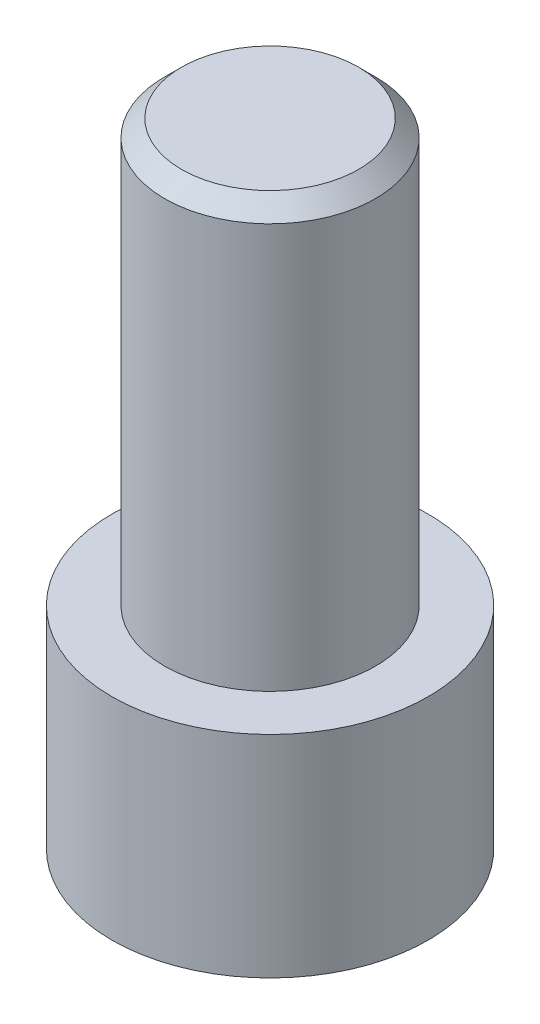
ISO-10303-21;
HEADER;
FILE_DESCRIPTION(('STEP AP214'),'2;1');
FILE_NAME('part.step','',(''),(''),'','','');
FILE_SCHEMA(('AUTOMOTIVE_DESIGN { 1 0 10303 214 1 1 1 1 }'));
ENDSEC;
DATA;
#1=APPLICATION_CONTEXT('core data for automotive mechanical design processes');
#2=APPLICATION_PROTOCOL_DEFINITION('international standard','automotive_design',2000,#1);
#3=PRODUCT_CONTEXT('',#1,'mechanical');
#4=PRODUCT('Part','Part','',(#3));
#5=PRODUCT_RELATED_PRODUCT_CATEGORY('part','',(#4));
#6=PRODUCT_DEFINITION_FORMATION('','',#4);
#7=PRODUCT_DEFINITION_CONTEXT('part definition',#1,'design');
#8=PRODUCT_DEFINITION('design','',#6,#7);
#9=PRODUCT_DEFINITION_SHAPE('','',#8);
#10=(LENGTH_UNIT() NAMED_UNIT(*) SI_UNIT(.MILLI.,.METRE.));
#11=(NAMED_UNIT(*) PLANE_ANGLE_UNIT() SI_UNIT($,.RADIAN.));
#12=(NAMED_UNIT(*) SI_UNIT($,.STERADIAN.) SOLID_ANGLE_UNIT());
#13=UNCERTAINTY_MEASURE_WITH_UNIT(LENGTH_MEASURE(1.E-05),#10,'distance_accuracy_value','');
#14=(GEOMETRIC_REPRESENTATION_CONTEXT(3) GLOBAL_UNCERTAINTY_ASSIGNED_CONTEXT((#13)) GLOBAL_UNIT_ASSIGNED_CONTEXT((#10,
#11,#12)) REPRESENTATION_CONTEXT('',''));
#15=CARTESIAN_POINT('',(0.,0.,0.));
#16=DIRECTION('',(0.,0.,1.));
#17=DIRECTION('',(1.,0.,0.));
#18=AXIS2_PLACEMENT_3D('',#15,#16,#17);
#19=CARTESIAN_POINT('',(0.,-6.35,0.));
#20=DIRECTION('',(0.,1.,0.));
#21=DIRECTION('',(0.,0.,1.));
#22=AXIS2_PLACEMENT_3D('',#19,#20,#21);
#23=CYLINDRICAL_SURFACE('',#22,4.7625);
#24=CARTESIAN_POINT('',(0.,-6.35,0.));
#25=DIRECTION('',(0.,1.,0.));
#26=DIRECTION('',(0.,0.,1.));
#27=AXIS2_PLACEMENT_3D('',#24,#25,#26);
#28=CIRCLE('',#27,4.7625);
#29=CARTESIAN_POINT('',(0.,-6.35,4.7625));
#30=VERTEX_POINT('',#29);
#31=EDGE_CURVE('E170',#30,#30,#28,.T.);
#32=ORIENTED_EDGE('',*,*,#31,.T.);
#33=EDGE_LOOP('',(#32));
#34=FACE_BOUND('',#33,.T.);
#35=CARTESIAN_POINT('',(0.,0.,0.));
#36=DIRECTION('',(0.,1.,0.));
#37=DIRECTION('',(0.,0.,1.));
#38=AXIS2_PLACEMENT_3D('',#35,#36,#37);
#39=CIRCLE('',#38,4.7625);
#40=CARTESIAN_POINT('',(0.,0.,4.7625));
#41=VERTEX_POINT('',#40);
#42=EDGE_CURVE('E156',#41,#41,#39,.T.);
#43=ORIENTED_EDGE('',*,*,#42,.F.);
#44=EDGE_LOOP('',(#43));
#45=FACE_BOUND('',#44,.T.);
#46=ADVANCED_FACE('F41',(#34,#45),#23,.T.);
#47=CARTESIAN_POINT('',(0.,-6.35,0.));
#48=DIRECTION('',(0.,1.,0.));
#49=DIRECTION('',(0.,0.,1.));
#50=AXIS2_PLACEMENT_3D('',#47,#48,#49);
#51=PLANE('',#50);
#52=DIRECTION('',(0.5,0.,0.866025403784439));
#53=VECTOR('',#52,1.);
#54=CARTESIAN_POINT('',(1.27,-6.35,-2.19970452561247));
#55=LINE('',#54,#53);
#56=CARTESIAN_POINT('',(1.27,-6.35,-2.19970452561247));
#57=VERTEX_POINT('',#56);
#58=CARTESIAN_POINT('',(2.54,-6.35,0.));
#59=VERTEX_POINT('',#58);
#60=EDGE_CURVE('E137',#57,#59,#55,.T.);
#61=ORIENTED_EDGE('',*,*,#60,.F.);
#62=DIRECTION('',(1.,0.,0.));
#63=VECTOR('',#62,1.);
#64=CARTESIAN_POINT('',(-1.27,-6.35,-2.19970452561247));
#65=LINE('',#64,#63);
#66=CARTESIAN_POINT('',(-1.27,-6.35,-2.19970452561247));
#67=VERTEX_POINT('',#66);
#68=EDGE_CURVE('E57',#67,#57,#65,.T.);
#69=ORIENTED_EDGE('',*,*,#68,.F.);
#70=DIRECTION('',(0.5,0.,-0.866025403784439));
#71=VECTOR('',#70,1.);
#72=CARTESIAN_POINT('',(-2.54,-6.35,0.));
#73=LINE('',#72,#71);
#74=CARTESIAN_POINT('',(-2.54,-6.35,0.));
#75=VERTEX_POINT('',#74);
#76=EDGE_CURVE('E150',#75,#67,#73,.T.);
#77=ORIENTED_EDGE('',*,*,#76,.F.);
#78=DIRECTION('',(-0.5,0.,-0.866025403784438));
#79=VECTOR('',#78,1.);
#80=CARTESIAN_POINT('',(-1.27,-6.35,2.19970452561247));
#81=LINE('',#80,#79);
#82=CARTESIAN_POINT('',(-1.27,-6.35,2.19970452561247));
#83=VERTEX_POINT('',#82);
#84=EDGE_CURVE('E147',#83,#75,#81,.T.);
#85=ORIENTED_EDGE('',*,*,#84,.F.);
#86=DIRECTION('',(-1.,0.,0.));
#87=VECTOR('',#86,1.);
#88=CARTESIAN_POINT('',(1.27,-6.35,2.19970452561247));
#89=LINE('',#88,#87);
#90=CARTESIAN_POINT('',(1.27,-6.35,2.19970452561247));
#91=VERTEX_POINT('',#90);
#92=EDGE_CURVE('E105',#91,#83,#89,.T.);
#93=ORIENTED_EDGE('',*,*,#92,.F.);
#94=DIRECTION('',(-0.5,0.,0.866025403784439));
#95=VECTOR('',#94,1.);
#96=CARTESIAN_POINT('',(2.54,-6.35,0.));
#97=LINE('',#96,#95);
#98=EDGE_CURVE('E141',#59,#91,#97,.T.);
#99=ORIENTED_EDGE('',*,*,#98,.F.);
#100=EDGE_LOOP('',(#61,#69,#77,#85,#93,#99));
#101=FACE_BOUND('',#100,.T.);
#102=ORIENTED_EDGE('',*,*,#31,.F.);
#103=EDGE_LOOP('',(#102));
#104=FACE_BOUND('',#103,.T.);
#105=ADVANCED_FACE('F195',(#101,#104),#51,.F.);
#106=CARTESIAN_POINT('',(0.,0.,0.));
#107=DIRECTION('',(0.,1.,0.));
#108=DIRECTION('',(0.,0.,1.));
#109=AXIS2_PLACEMENT_3D('',#106,#107,#108);
#110=PLANE('',#109);
#111=CARTESIAN_POINT('',(0.,0.,0.));
#112=DIRECTION('',(0.,1.,0.));
#113=DIRECTION('',(0.,0.,1.));
#114=AXIS2_PLACEMENT_3D('',#111,#112,#113);
#115=CIRCLE('',#114,3.175);
#116=CARTESIAN_POINT('',(0.,0.,3.175));
#117=VERTEX_POINT('',#116);
#118=EDGE_CURVE('E166',#117,#117,#115,.T.);
#119=ORIENTED_EDGE('',*,*,#118,.F.);
#120=EDGE_LOOP('',(#119));
#121=FACE_BOUND('',#120,.T.);
#122=ORIENTED_EDGE('',*,*,#42,.T.);
#123=EDGE_LOOP('',(#122));
#124=FACE_BOUND('',#123,.T.);
#125=ADVANCED_FACE('F200',(#121,#124),#110,.T.);
#126=CARTESIAN_POINT('',(0.,12.7,0.));
#127=DIRECTION('',(0.,-1.,0.));
#128=DIRECTION('',(0.,0.,-1.));
#129=AXIS2_PLACEMENT_3D('',#126,#127,#128);
#130=CYLINDRICAL_SURFACE('',#129,3.175);
#131=CARTESIAN_POINT('',(0.,12.192,0.));
#132=DIRECTION('',(0.,1.,0.));
#133=DIRECTION('',(0.,0.,1.));
#134=AXIS2_PLACEMENT_3D('',#131,#132,#133);
#135=CIRCLE('',#134,3.175);
#136=CARTESIAN_POINT('',(0.,12.192,3.175));
#137=VERTEX_POINT('',#136);
#138=EDGE_CURVE('E11',#137,#137,#135,.F.);
#139=ORIENTED_EDGE('',*,*,#138,.T.);
#140=EDGE_LOOP('',(#139));
#141=FACE_BOUND('',#140,.T.);
#142=ORIENTED_EDGE('',*,*,#118,.T.);
#143=EDGE_LOOP('',(#142));
#144=FACE_BOUND('',#143,.T.);
#145=ADVANCED_FACE('F191',(#141,#144),#130,.T.);
#146=CARTESIAN_POINT('',(0.,12.7,0.));
#147=DIRECTION('',(0.,1.,0.));
#148=DIRECTION('',(0.,0.,1.));
#149=AXIS2_PLACEMENT_3D('',#146,#147,#148);
#150=PLANE('',#149);
#151=CARTESIAN_POINT('',(0.,12.7,0.));
#152=DIRECTION('',(0.,1.,0.));
#153=DIRECTION('',(0.,0.,1.));
#154=AXIS2_PLACEMENT_3D('',#151,#152,#153);
#155=CIRCLE('',#154,2.667);
#156=CARTESIAN_POINT('',(0.,12.7,2.667));
#157=VERTEX_POINT('',#156);
#158=EDGE_CURVE('E50',#157,#157,#155,.T.);
#159=ORIENTED_EDGE('',*,*,#158,.T.);
#160=EDGE_LOOP('',(#159));
#161=FACE_BOUND('',#160,.T.);
#162=ADVANCED_FACE('F180',(#161),#150,.T.);
#163=CARTESIAN_POINT('',(0.,12.7,0.));
#164=DIRECTION('',(0.,-1.,0.));
#165=DIRECTION('',(0.,0.,-1.));
#166=AXIS2_PLACEMENT_3D('',#163,#164,#165);
#167=CONICAL_SURFACE('',#166,2.667,0.785398163397444);
#168=ORIENTED_EDGE('',*,*,#138,.F.);
#169=EDGE_LOOP('',(#168));
#170=FACE_BOUND('',#169,.T.);
#171=ORIENTED_EDGE('',*,*,#158,.F.);
#172=EDGE_LOOP('',(#171));
#173=FACE_BOUND('',#172,.T.);
#174=ADVANCED_FACE('F43',(#170,#173),#167,.T.);
#175=CARTESIAN_POINT('',(-1.27,-2.54,-2.19970452561247));
#176=DIRECTION('',(0.,0.,-1.));
#177=DIRECTION('',(-1.,0.,0.));
#178=AXIS2_PLACEMENT_3D('',#175,#176,#177);
#179=PLANE('',#178);
#180=ORIENTED_EDGE('',*,*,#68,.T.);
#181=DIRECTION('',(0.,-1.,0.));
#182=VECTOR('',#181,1.);
#183=CARTESIAN_POINT('',(1.27,-2.54,-2.19970452561247));
#184=LINE('',#183,#182);
#185=CARTESIAN_POINT('',(1.27,-2.54,-2.19970452561247));
#186=VERTEX_POINT('',#185);
#187=EDGE_CURVE('E87',#186,#57,#184,.T.);
#188=ORIENTED_EDGE('',*,*,#187,.F.);
#189=DIRECTION('',(1.,0.,0.));
#190=VECTOR('',#189,1.);
#191=CARTESIAN_POINT('',(-1.27,-2.54,-2.19970452561247));
#192=LINE('',#191,#190);
#193=CARTESIAN_POINT('',(-1.27,-2.54,-2.19970452561247));
#194=VERTEX_POINT('',#193);
#195=EDGE_CURVE('E153',#194,#186,#192,.T.);
#196=ORIENTED_EDGE('',*,*,#195,.F.);
#197=DIRECTION('',(0.,-1.,0.));
#198=VECTOR('',#197,1.);
#199=CARTESIAN_POINT('',(-1.27,-2.54,-2.19970452561247));
#200=LINE('',#199,#198);
#201=EDGE_CURVE('E65',#194,#67,#200,.T.);
#202=ORIENTED_EDGE('',*,*,#201,.T.);
#203=EDGE_LOOP('',(#180,#188,#196,#202));
#204=FACE_BOUND('',#203,.T.);
#205=ADVANCED_FACE('F183',(#204),#179,.F.);
#206=CARTESIAN_POINT('',(-2.54,-2.54,0.));
#207=DIRECTION('',(-0.866025403784439,0.,-0.5));
#208=DIRECTION('',(-0.5,0.,0.866025403784439));
#209=AXIS2_PLACEMENT_3D('',#206,#207,#208);
#210=PLANE('',#209);
#211=ORIENTED_EDGE('',*,*,#76,.T.);
#212=ORIENTED_EDGE('',*,*,#201,.F.);
#213=DIRECTION('',(0.5,0.,-0.866025403784439));
#214=VECTOR('',#213,1.);
#215=CARTESIAN_POINT('',(-2.54,-2.54,0.));
#216=LINE('',#215,#214);
#217=CARTESIAN_POINT('',(-2.54,-2.54,0.));
#218=VERTEX_POINT('',#217);
#219=EDGE_CURVE('E119',#218,#194,#216,.T.);
#220=ORIENTED_EDGE('',*,*,#219,.F.);
#221=DIRECTION('',(0.,-1.,0.));
#222=VECTOR('',#221,1.);
#223=CARTESIAN_POINT('',(-2.54,-2.54,0.));
#224=LINE('',#223,#222);
#225=EDGE_CURVE('E110',#218,#75,#224,.T.);
#226=ORIENTED_EDGE('',*,*,#225,.T.);
#227=EDGE_LOOP('',(#211,#212,#220,#226));
#228=FACE_BOUND('',#227,.T.);
#229=ADVANCED_FACE('F189',(#228),#210,.F.);
#230=CARTESIAN_POINT('',(-1.27,-2.54,2.19970452561247));
#231=DIRECTION('',(-0.866025403784438,0.,0.5));
#232=DIRECTION('',(0.5,0.,0.866025403784439));
#233=AXIS2_PLACEMENT_3D('',#230,#231,#232);
#234=PLANE('',#233);
#235=ORIENTED_EDGE('',*,*,#84,.T.);
#236=ORIENTED_EDGE('',*,*,#225,.F.);
#237=DIRECTION('',(-0.5,0.,-0.866025403784438));
#238=VECTOR('',#237,1.);
#239=CARTESIAN_POINT('',(-1.27,-2.54,2.19970452561247));
#240=LINE('',#239,#238);
#241=CARTESIAN_POINT('',(-1.27,-2.54,2.19970452561247));
#242=VERTEX_POINT('',#241);
#243=EDGE_CURVE('E114',#242,#218,#240,.T.);
#244=ORIENTED_EDGE('',*,*,#243,.F.);
#245=DIRECTION('',(0.,-1.,0.));
#246=VECTOR('',#245,1.);
#247=CARTESIAN_POINT('',(-1.27,-2.54,2.19970452561247));
#248=LINE('',#247,#246);
#249=EDGE_CURVE('E98',#242,#83,#248,.T.);
#250=ORIENTED_EDGE('',*,*,#249,.T.);
#251=EDGE_LOOP('',(#235,#236,#244,#250));
#252=FACE_BOUND('',#251,.T.);
#253=ADVANCED_FACE('F115',(#252),#234,.F.);
#254=CARTESIAN_POINT('',(1.27,-2.54,2.19970452561247));
#255=DIRECTION('',(0.,0.,1.));
#256=DIRECTION('',(1.,0.,0.));
#257=AXIS2_PLACEMENT_3D('',#254,#255,#256);
#258=PLANE('',#257);
#259=ORIENTED_EDGE('',*,*,#92,.T.);
#260=ORIENTED_EDGE('',*,*,#249,.F.);
#261=DIRECTION('',(-1.,0.,0.));
#262=VECTOR('',#261,1.);
#263=CARTESIAN_POINT('',(1.27,-2.54,2.19970452561247));
#264=LINE('',#263,#262);
#265=CARTESIAN_POINT('',(1.27,-2.54,2.19970452561247));
#266=VERTEX_POINT('',#265);
#267=EDGE_CURVE('E102',#266,#242,#264,.T.);
#268=ORIENTED_EDGE('',*,*,#267,.F.);
#269=DIRECTION('',(0.,-1.,0.));
#270=VECTOR('',#269,1.);
#271=CARTESIAN_POINT('',(1.27,-2.54,2.19970452561247));
#272=LINE('',#271,#270);
#273=EDGE_CURVE('E111',#266,#91,#272,.T.);
#274=ORIENTED_EDGE('',*,*,#273,.T.);
#275=EDGE_LOOP('',(#259,#260,#268,#274));
#276=FACE_BOUND('',#275,.T.);
#277=ADVANCED_FACE('F100',(#276),#258,.F.);
#278=CARTESIAN_POINT('',(2.54,-2.54,0.));
#279=DIRECTION('',(0.866025403784439,0.,0.5));
#280=DIRECTION('',(0.5,0.,-0.866025403784439));
#281=AXIS2_PLACEMENT_3D('',#278,#279,#280);
#282=PLANE('',#281);
#283=ORIENTED_EDGE('',*,*,#98,.T.);
#284=ORIENTED_EDGE('',*,*,#273,.F.);
#285=DIRECTION('',(-0.5,0.,0.866025403784439));
#286=VECTOR('',#285,1.);
#287=CARTESIAN_POINT('',(2.54,-2.54,0.));
#288=LINE('',#287,#286);
#289=CARTESIAN_POINT('',(2.54,-2.54,0.));
#290=VERTEX_POINT('',#289);
#291=EDGE_CURVE('E125',#290,#266,#288,.T.);
#292=ORIENTED_EDGE('',*,*,#291,.F.);
#293=DIRECTION('',(0.,-1.,0.));
#294=VECTOR('',#293,1.);
#295=CARTESIAN_POINT('',(2.54,-2.54,0.));
#296=LINE('',#295,#294);
#297=EDGE_CURVE('E161',#290,#59,#296,.T.);
#298=ORIENTED_EDGE('',*,*,#297,.T.);
#299=EDGE_LOOP('',(#283,#284,#292,#298));
#300=FACE_BOUND('',#299,.T.);
#301=ADVANCED_FACE('F214',(#300),#282,.F.);
#302=CARTESIAN_POINT('',(1.27,-2.54,-2.19970452561247));
#303=DIRECTION('',(0.866025403784439,0.,-0.5));
#304=DIRECTION('',(-0.5,0.,-0.866025403784439));
#305=AXIS2_PLACEMENT_3D('',#302,#303,#304);
#306=PLANE('',#305);
#307=ORIENTED_EDGE('',*,*,#60,.T.);
#308=ORIENTED_EDGE('',*,*,#297,.F.);
#309=DIRECTION('',(0.5,0.,0.866025403784439));
#310=VECTOR('',#309,1.);
#311=CARTESIAN_POINT('',(1.27,-2.54,-2.19970452561247));
#312=LINE('',#311,#310);
#313=EDGE_CURVE('E129',#186,#290,#312,.T.);
#314=ORIENTED_EDGE('',*,*,#313,.F.);
#315=ORIENTED_EDGE('',*,*,#187,.T.);
#316=EDGE_LOOP('',(#307,#308,#314,#315));
#317=FACE_BOUND('',#316,.T.);
#318=ADVANCED_FACE('F211',(#317),#306,.F.);
#319=CARTESIAN_POINT('',(0.,-2.54,0.));
#320=DIRECTION('',(0.,-1.,0.));
#321=DIRECTION('',(0.,0.,-1.));
#322=AXIS2_PLACEMENT_3D('',#319,#320,#321);
#323=PLANE('',#322);
#324=ORIENTED_EDGE('',*,*,#195,.T.);
#325=ORIENTED_EDGE('',*,*,#313,.T.);
#326=ORIENTED_EDGE('',*,*,#291,.T.);
#327=ORIENTED_EDGE('',*,*,#267,.T.);
#328=ORIENTED_EDGE('',*,*,#243,.T.);
#329=ORIENTED_EDGE('',*,*,#219,.T.);
#330=EDGE_LOOP('',(#324,#325,#326,#327,#328,#329));
#331=FACE_BOUND('',#330,.T.);
#332=ADVANCED_FACE('F122',(#331),#323,.T.);
#333=CLOSED_SHELL('',(#46,#105,#125,#145,#162,#174,#205,#229,#253,#277,#301,#318,#332));
#334=MANIFOLD_SOLID_BREP('B2',#333);
#335=ADVANCED_BREP_SHAPE_REPRESENTATION('',(#18,#334),#14);
#336=SHAPE_DEFINITION_REPRESENTATION(#9,#335);
ENDSEC;
END-ISO-10303-21;
